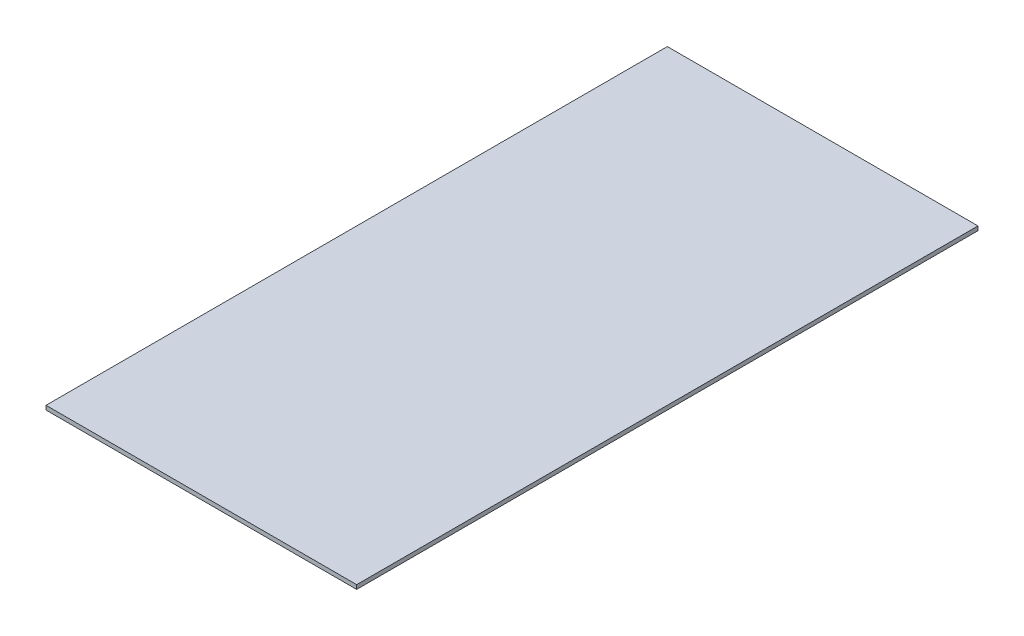
ISO-10303-21;
HEADER;
FILE_DESCRIPTION(('STEP AP214'),'2;1');
FILE_NAME('part.step','',(''),(''),'','','');
FILE_SCHEMA(('AUTOMOTIVE_DESIGN { 1 0 10303 214 1 1 1 1 }'));
ENDSEC;
DATA;
#1=APPLICATION_CONTEXT('core data for automotive mechanical design processes');
#2=APPLICATION_PROTOCOL_DEFINITION('international standard','automotive_design',2000,#1);
#3=PRODUCT_CONTEXT('',#1,'mechanical');
#4=PRODUCT('Part','Part','',(#3));
#5=PRODUCT_RELATED_PRODUCT_CATEGORY('part','',(#4));
#6=PRODUCT_DEFINITION_FORMATION('','',#4);
#7=PRODUCT_DEFINITION_CONTEXT('part definition',#1,'design');
#8=PRODUCT_DEFINITION('design','',#6,#7);
#9=PRODUCT_DEFINITION_SHAPE('','',#8);
#10=(LENGTH_UNIT() NAMED_UNIT(*) SI_UNIT(.MILLI.,.METRE.));
#11=(NAMED_UNIT(*) PLANE_ANGLE_UNIT() SI_UNIT($,.RADIAN.));
#12=(NAMED_UNIT(*) SI_UNIT($,.STERADIAN.) SOLID_ANGLE_UNIT());
#13=UNCERTAINTY_MEASURE_WITH_UNIT(LENGTH_MEASURE(1.E-05),#10,'distance_accuracy_value','');
#14=(GEOMETRIC_REPRESENTATION_CONTEXT(3) GLOBAL_UNCERTAINTY_ASSIGNED_CONTEXT((#13)) GLOBAL_UNIT_ASSIGNED_CONTEXT((#10,
#11,#12)) REPRESENTATION_CONTEXT('',''));
#15=CARTESIAN_POINT('',(0.,0.,0.));
#16=DIRECTION('',(0.,0.,1.));
#17=DIRECTION('',(1.,0.,0.));
#18=AXIS2_PLACEMENT_3D('',#15,#16,#17);
#19=CARTESIAN_POINT('',(-257.142857142857,273.588039867109,1800.));
#20=DIRECTION('',(1.,0.,0.));
#21=DIRECTION('',(0.,1.,0.));
#22=AXIS2_PLACEMENT_3D('',#19,#20,#21);
#23=PLANE('',#22);
#24=DIRECTION('',(0.,-1.,0.));
#25=VECTOR('',#24,1.);
#26=CARTESIAN_POINT('',(-257.142857142857,273.588039867109,0.));
#27=LINE('',#26,#25);
#28=CARTESIAN_POINT('',(-257.142857142857,273.588039867109,0.));
#29=VERTEX_POINT('',#28);
#30=CARTESIAN_POINT('',(-257.142857142857,261.588039867109,0.));
#31=VERTEX_POINT('',#30);
#32=EDGE_CURVE('E100',#29,#31,#27,.T.);
#33=ORIENTED_EDGE('',*,*,#32,.T.);
#34=DIRECTION('',(0.,0.,-1.));
#35=VECTOR('',#34,1.);
#36=CARTESIAN_POINT('',(-257.142857142857,261.588039867109,1800.));
#37=LINE('',#36,#35);
#38=CARTESIAN_POINT('',(-257.142857142857,261.588039867109,1800.));
#39=VERTEX_POINT('',#38);
#40=EDGE_CURVE('E11',#39,#31,#37,.T.);
#41=ORIENTED_EDGE('',*,*,#40,.F.);
#42=DIRECTION('',(0.,-1.,0.));
#43=VECTOR('',#42,1.);
#44=CARTESIAN_POINT('',(-257.142857142857,273.588039867109,1800.));
#45=LINE('',#44,#43);
#46=CARTESIAN_POINT('',(-257.142857142857,273.588039867109,1800.));
#47=VERTEX_POINT('',#46);
#48=EDGE_CURVE('E88',#47,#39,#45,.T.);
#49=ORIENTED_EDGE('',*,*,#48,.F.);
#50=DIRECTION('',(0.,0.,-1.));
#51=VECTOR('',#50,1.);
#52=CARTESIAN_POINT('',(-257.142857142857,273.588039867109,1800.));
#53=LINE('',#52,#51);
#54=EDGE_CURVE('E96',#47,#29,#53,.T.);
#55=ORIENTED_EDGE('',*,*,#54,.T.);
#56=EDGE_LOOP('',(#33,#41,#49,#55));
#57=FACE_BOUND('',#56,.T.);
#58=ADVANCED_FACE('F37',(#57),#23,.F.);
#59=CARTESIAN_POINT('',(-257.142857142857,261.588039867109,1800.));
#60=DIRECTION('',(0.,1.,0.));
#61=DIRECTION('',(0.,0.,1.));
#62=AXIS2_PLACEMENT_3D('',#59,#60,#61);
#63=PLANE('',#62);
#64=DIRECTION('',(1.,0.,0.));
#65=VECTOR('',#64,1.);
#66=CARTESIAN_POINT('',(-257.142857142857,261.588039867109,0.));
#67=LINE('',#66,#65);
#68=CARTESIAN_POINT('',(642.857142857143,261.588039867109,0.));
#69=VERTEX_POINT('',#68);
#70=EDGE_CURVE('E92',#31,#69,#67,.T.);
#71=ORIENTED_EDGE('',*,*,#70,.T.);
#72=DIRECTION('',(0.,0.,-1.));
#73=VECTOR('',#72,1.);
#74=CARTESIAN_POINT('',(642.857142857143,261.588039867109,1800.));
#75=LINE('',#74,#73);
#76=CARTESIAN_POINT('',(642.857142857143,261.588039867109,1800.));
#77=VERTEX_POINT('',#76);
#78=EDGE_CURVE('E45',#77,#69,#75,.T.);
#79=ORIENTED_EDGE('',*,*,#78,.F.);
#80=DIRECTION('',(1.,0.,0.));
#81=VECTOR('',#80,1.);
#82=CARTESIAN_POINT('',(-257.142857142857,261.588039867109,1800.));
#83=LINE('',#82,#81);
#84=EDGE_CURVE('E83',#39,#77,#83,.T.);
#85=ORIENTED_EDGE('',*,*,#84,.F.);
#86=ORIENTED_EDGE('',*,*,#40,.T.);
#87=EDGE_LOOP('',(#71,#79,#85,#86));
#88=FACE_BOUND('',#87,.T.);
#89=ADVANCED_FACE('F91',(#88),#63,.F.);
#90=CARTESIAN_POINT('',(642.857142857143,273.588039867109,1800.));
#91=DIRECTION('',(-1.,0.,0.));
#92=DIRECTION('',(0.,-1.,0.));
#93=AXIS2_PLACEMENT_3D('',#90,#91,#92);
#94=PLANE('',#93);
#95=DIRECTION('',(0.,1.,0.));
#96=VECTOR('',#95,1.);
#97=CARTESIAN_POINT('',(642.857142857143,273.588039867109,0.));
#98=LINE('',#97,#96);
#99=CARTESIAN_POINT('',(642.857142857143,273.588039867109,0.));
#100=VERTEX_POINT('',#99);
#101=EDGE_CURVE('E70',#69,#100,#98,.T.);
#102=ORIENTED_EDGE('',*,*,#101,.T.);
#103=DIRECTION('',(0.,0.,-1.));
#104=VECTOR('',#103,1.);
#105=CARTESIAN_POINT('',(642.857142857143,273.588039867109,1800.));
#106=LINE('',#105,#104);
#107=CARTESIAN_POINT('',(642.857142857143,273.588039867109,1800.));
#108=VERTEX_POINT('',#107);
#109=EDGE_CURVE('E93',#108,#100,#106,.T.);
#110=ORIENTED_EDGE('',*,*,#109,.F.);
#111=DIRECTION('',(0.,1.,0.));
#112=VECTOR('',#111,1.);
#113=CARTESIAN_POINT('',(642.857142857143,273.588039867109,1800.));
#114=LINE('',#113,#112);
#115=EDGE_CURVE('E86',#77,#108,#114,.T.);
#116=ORIENTED_EDGE('',*,*,#115,.F.);
#117=ORIENTED_EDGE('',*,*,#78,.T.);
#118=EDGE_LOOP('',(#102,#110,#116,#117));
#119=FACE_BOUND('',#118,.T.);
#120=ADVANCED_FACE('F94',(#119),#94,.F.);
#121=CARTESIAN_POINT('',(-257.142857142857,273.588039867109,1800.));
#122=DIRECTION('',(0.,-1.,0.));
#123=DIRECTION('',(0.,0.,-1.));
#124=AXIS2_PLACEMENT_3D('',#121,#122,#123);
#125=PLANE('',#124);
#126=DIRECTION('',(-1.,0.,0.));
#127=VECTOR('',#126,1.);
#128=CARTESIAN_POINT('',(-257.142857142857,273.588039867109,0.));
#129=LINE('',#128,#127);
#130=EDGE_CURVE('E76',#100,#29,#129,.T.);
#131=ORIENTED_EDGE('',*,*,#130,.T.);
#132=ORIENTED_EDGE('',*,*,#54,.F.);
#133=DIRECTION('',(-1.,0.,0.));
#134=VECTOR('',#133,1.);
#135=CARTESIAN_POINT('',(-257.142857142857,273.588039867109,1800.));
#136=LINE('',#135,#134);
#137=EDGE_CURVE('E53',#108,#47,#136,.T.);
#138=ORIENTED_EDGE('',*,*,#137,.F.);
#139=ORIENTED_EDGE('',*,*,#109,.T.);
#140=EDGE_LOOP('',(#131,#132,#138,#139));
#141=FACE_BOUND('',#140,.T.);
#142=ADVANCED_FACE('F107',(#141),#125,.F.);
#143=CARTESIAN_POINT('',(0.,0.,1800.));
#144=DIRECTION('',(0.,0.,1.));
#145=DIRECTION('',(1.,0.,0.));
#146=AXIS2_PLACEMENT_3D('',#143,#144,#145);
#147=PLANE('',#146);
#148=ORIENTED_EDGE('',*,*,#48,.T.);
#149=ORIENTED_EDGE('',*,*,#84,.T.);
#150=ORIENTED_EDGE('',*,*,#115,.T.);
#151=ORIENTED_EDGE('',*,*,#137,.T.);
#152=EDGE_LOOP('',(#148,#149,#150,#151));
#153=FACE_BOUND('',#152,.T.);
#154=ADVANCED_FACE('F84',(#153),#147,.T.);
#155=CARTESIAN_POINT('',(0.,0.,0.));
#156=DIRECTION('',(0.,0.,1.));
#157=DIRECTION('',(1.,0.,0.));
#158=AXIS2_PLACEMENT_3D('',#155,#156,#157);
#159=PLANE('',#158);
#160=ORIENTED_EDGE('',*,*,#32,.F.);
#161=ORIENTED_EDGE('',*,*,#130,.F.);
#162=ORIENTED_EDGE('',*,*,#101,.F.);
#163=ORIENTED_EDGE('',*,*,#70,.F.);
#164=EDGE_LOOP('',(#160,#161,#162,#163));
#165=FACE_BOUND('',#164,.T.);
#166=ADVANCED_FACE('F110',(#165),#159,.F.);
#167=CLOSED_SHELL('',(#58,#89,#120,#142,#154,#166));
#168=MANIFOLD_SOLID_BREP('B2',#167);
#169=ADVANCED_BREP_SHAPE_REPRESENTATION('',(#18,#168),#14);
#170=SHAPE_DEFINITION_REPRESENTATION(#9,#169);
ENDSEC;
END-ISO-10303-21;
